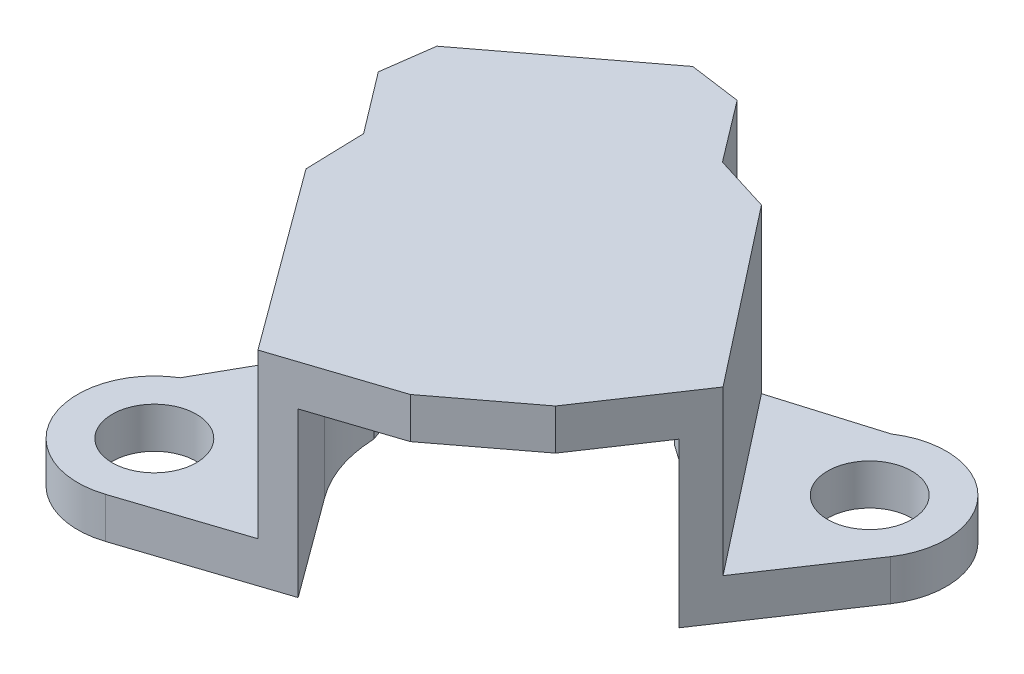
ISO-10303-21;
HEADER;
FILE_DESCRIPTION(('STEP AP214'),'2;1');
FILE_NAME('part.step','',(''),(''),'','','');
FILE_SCHEMA(('AUTOMOTIVE_DESIGN { 1 0 10303 214 1 1 1 1 }'));
ENDSEC;
DATA;
#1=APPLICATION_CONTEXT('core data for automotive mechanical design processes');
#2=APPLICATION_PROTOCOL_DEFINITION('international standard','automotive_design',2000,#1);
#3=PRODUCT_CONTEXT('',#1,'mechanical');
#4=PRODUCT('Part','Part','',(#3));
#5=PRODUCT_RELATED_PRODUCT_CATEGORY('part','',(#4));
#6=PRODUCT_DEFINITION_FORMATION('','',#4);
#7=PRODUCT_DEFINITION_CONTEXT('part definition',#1,'design');
#8=PRODUCT_DEFINITION('design','',#6,#7);
#9=PRODUCT_DEFINITION_SHAPE('','',#8);
#10=(LENGTH_UNIT() NAMED_UNIT(*) SI_UNIT(.MILLI.,.METRE.));
#11=(NAMED_UNIT(*) PLANE_ANGLE_UNIT() SI_UNIT($,.RADIAN.));
#12=(NAMED_UNIT(*) SI_UNIT($,.STERADIAN.) SOLID_ANGLE_UNIT());
#13=UNCERTAINTY_MEASURE_WITH_UNIT(LENGTH_MEASURE(1.E-05),#10,'distance_accuracy_value','');
#14=(GEOMETRIC_REPRESENTATION_CONTEXT(3) GLOBAL_UNCERTAINTY_ASSIGNED_CONTEXT((#13)) GLOBAL_UNIT_ASSIGNED_CONTEXT((#10,
#11,#12)) REPRESENTATION_CONTEXT('',''));
#15=CARTESIAN_POINT('',(0.,0.,0.));
#16=DIRECTION('',(0.,0.,1.));
#17=DIRECTION('',(1.,0.,0.));
#18=AXIS2_PLACEMENT_3D('',#15,#16,#17);
#19=CARTESIAN_POINT('',(0.,0.,0.));
#20=DIRECTION('',(0.,1.,0.));
#21=DIRECTION('',(0.,0.,1.));
#22=AXIS2_PLACEMENT_3D('',#19,#20,#21);
#23=PLANE('',#22);
#24=CARTESIAN_POINT('',(-10.5064328223958,0.,9.86179941757788));
#25=DIRECTION('',(0.,1.,0.));
#26=DIRECTION('',(0.,0.,1.));
#27=AXIS2_PLACEMENT_3D('',#24,#25,#26);
#28=CIRCLE('',#27,2.61619999992092);
#29=CARTESIAN_POINT('',(-10.5064328223958,0.,12.4779994174988));
#30=VERTEX_POINT('',#29);
#31=EDGE_CURVE('E192',#30,#30,#28,.T.);
#32=ORIENTED_EDGE('',*,*,#31,.T.);
#33=EDGE_LOOP('',(#32));
#34=FACE_BOUND('',#33,.T.);
#35=CARTESIAN_POINT('',(14.7920616338196,0.,-9.32279539828221));
#36=DIRECTION('',(0.,1.,0.));
#37=DIRECTION('',(0.,0.,1.));
#38=AXIS2_PLACEMENT_3D('',#35,#36,#37);
#39=CIRCLE('',#38,2.61619999992374);
#40=CARTESIAN_POINT('',(14.7920616338196,0.,-6.70659539835847));
#41=VERTEX_POINT('',#40);
#42=EDGE_CURVE('E233',#41,#41,#39,.T.);
#43=ORIENTED_EDGE('',*,*,#42,.T.);
#44=EDGE_LOOP('',(#43));
#45=FACE_BOUND('',#44,.T.);
#46=DIRECTION('',(0.591892658554333,0.,0.806016799297312));
#47=VECTOR('',#46,1.);
#48=CARTESIAN_POINT('',(-5.45155253612325,0.,4.00330852491869));
#49=LINE('',#48,#47);
#50=CARTESIAN_POINT('',(-4.57227275259217,0.,5.20067812659536));
#51=VERTEX_POINT('',#50);
#52=CARTESIAN_POINT('',(-0.00583235667560387,0.,11.4190821208067));
#53=VERTEX_POINT('',#52);
#54=EDGE_CURVE('E190',#51,#53,#49,.T.);
#55=ORIENTED_EDGE('',*,*,#54,.T.);
#56=DIRECTION('',(0.949859382125711,0.,-0.312677396349277));
#57=VECTOR('',#56,1.);
#58=CARTESIAN_POINT('',(3.39089213545186,0.,10.3009387510614));
#59=LINE('',#58,#57);
#60=CARTESIAN_POINT('',(-9.01730672237663,0.,14.3855047249459));
#61=VERTEX_POINT('',#60);
#62=EDGE_CURVE('E174',#61,#53,#59,.T.);
#63=ORIENTED_EDGE('',*,*,#62,.F.);
#64=CARTESIAN_POINT('',(-10.5064328223958,0.,9.86179941757788));
#65=DIRECTION('',(0.,1.,0.));
#66=DIRECTION('',(0.,0.,1.));
#67=AXIS2_PLACEMENT_3D('',#64,#65,#66);
#68=CIRCLE('',#67,4.76249999992099);
#69=CARTESIAN_POINT('',(-12.9701796141644,0.,5.7860960432242));
#70=VERTEX_POINT('',#69);
#71=EDGE_CURVE('E163',#70,#61,#68,.T.);
#72=ORIENTED_EDGE('',*,*,#71,.F.);
#73=DIRECTION('',(0.491262576943974,0.,-0.871011527187997));
#74=VECTOR('',#73,1.);
#75=CARTESIAN_POINT('',(-7.36412678812746,0.,-4.15346960396405));
#76=LINE('',#75,#74);
#77=CARTESIAN_POINT('',(-10.1498290810193,0.,0.785597449579397));
#78=VERTEX_POINT('',#77);
#79=EDGE_CURVE('E175',#70,#78,#76,.T.);
#80=ORIENTED_EDGE('',*,*,#79,.T.);
#81=DIRECTION('',(-0.0288086920511689,0.,-0.999584943495199));
#82=VECTOR('',#81,1.);
#83=CARTESIAN_POINT('',(-10.1640279658121,0.,0.292933935802079));
#84=LINE('',#83,#82);
#85=CARTESIAN_POINT('',(-10.2561205686825,0.,-2.90243429101753));
#86=VERTEX_POINT('',#85);
#87=EDGE_CURVE('E350',#78,#86,#84,.T.);
#88=ORIENTED_EDGE('',*,*,#87,.T.);
#89=DIRECTION('',(-0.604239206798796,0.,-0.79680297499894));
#90=VECTOR('',#89,1.);
#91=CARTESIAN_POINT('',(-5.11415462747085,0.,3.87821435475123));
#92=LINE('',#91,#90);
#93=CARTESIAN_POINT('',(-13.1267215123253,0.,-6.68786123152895));
#94=VERTEX_POINT('',#93);
#95=EDGE_CURVE('E414',#86,#94,#92,.T.);
#96=ORIENTED_EDGE('',*,*,#95,.T.);
#97=DIRECTION('',(0.136163146305156,0.,-0.990686427477575));
#98=VECTOR('',#97,1.);
#99=CARTESIAN_POINT('',(-13.7855057266784,0.,-1.89472448707263));
#100=LINE('',#99,#98);
#101=CARTESIAN_POINT('',(-12.6865207382198,0.,-9.89064365911864));
#102=VERTEX_POINT('',#101);
#103=EDGE_CURVE('E410',#94,#102,#100,.T.);
#104=ORIENTED_EDGE('',*,*,#103,.T.);
#105=DIRECTION('',(0.796802974998941,0.,-0.604239206798796));
#106=VECTOR('',#105,1.);
#107=CARTESIAN_POINT('',(-9.39385771159657,0.,-12.3875671871278));
#108=LINE('',#107,#106);
#109=CARTESIAN_POINT('',(-3.63977912067687,0.,-16.7510547652708));
#110=VERTEX_POINT('',#109);
#111=EDGE_CURVE('E406',#102,#110,#108,.T.);
#112=ORIENTED_EDGE('',*,*,#111,.T.);
#113=DIRECTION('',(0.990686427477575,0.,0.136163146305156));
#114=VECTOR('',#113,1.);
#115=CARTESIAN_POINT('',(2.19215024415396,0.,-15.9494955338935));
#116=LINE('',#115,#114);
#117=CARTESIAN_POINT('',(-0.436996693087231,0.,-16.3108539911652));
#118=VERTEX_POINT('',#117);
#119=EDGE_CURVE('E402',#110,#118,#116,.T.);
#120=ORIENTED_EDGE('',*,*,#119,.T.);
#121=DIRECTION('',(0.604239206798796,0.,0.796802974998941));
#122=VECTOR('',#121,1.);
#123=CARTESIAN_POINT('',(7.57557019176729,0.,-5.74477840488503));
#124=LINE('',#123,#122);
#125=CARTESIAN_POINT('',(2.43360425055577,0.,-12.5254270506537));
#126=VERTEX_POINT('',#125);
#127=EDGE_CURVE('E398',#118,#126,#124,.T.);
#128=ORIENTED_EDGE('',*,*,#127,.T.);
#129=DIRECTION('',(0.954747233375275,0.,0.29741842640001));
#130=VECTOR('',#129,1.);
#131=CARTESIAN_POINT('',(3.77198408182087,0.,-12.1085011781029));
#132=LINE('',#131,#130);
#133=CARTESIAN_POINT('',(5.95620442966988,0.,-11.4280829940444));
#134=VERTEX_POINT('',#133);
#135=EDGE_CURVE('E394',#126,#134,#132,.T.);
#136=ORIENTED_EDGE('',*,*,#135,.T.);
#137=DIRECTION('',(0.957633513743613,0.,-0.287989675778597));
#138=VECTOR('',#137,1.);
#139=CARTESIAN_POINT('',(-2.65773861042091,0.,-8.83760696361255));
#140=LINE('',#139,#138);
#141=CARTESIAN_POINT('',(12.1651755509115,0.,-13.2953104400561));
#142=VERTEX_POINT('',#141);
#143=EDGE_CURVE('E306',#134,#142,#140,.T.);
#144=ORIENTED_EDGE('',*,*,#143,.T.);
#145=CARTESIAN_POINT('',(14.7920616338196,0.,-9.32279539828221));
#146=DIRECTION('',(0.,1.,0.));
#147=DIRECTION('',(0.,0.,1.));
#148=AXIS2_PLACEMENT_3D('',#145,#146,#147);
#149=CIRCLE('',#148,4.76249999992396);
#150=CARTESIAN_POINT('',(18.7462730337282,0.,-6.66843700979547));
#151=VERTEX_POINT('',#150);
#152=EDGE_CURVE('E326',#151,#142,#149,.T.);
#153=ORIENTED_EDGE('',*,*,#152,.F.);
#154=DIRECTION('',(0.557345593389218,0.,-0.830280608908591));
#155=VECTOR('',#154,1.);
#156=CARTESIAN_POINT('',(9.83720036227,0.,6.60345456026617));
#157=LINE('',#156,#155);
#158=CARTESIAN_POINT('',(13.4563241890389,0.,1.21202710439891));
#159=VERTEX_POINT('',#158);
#160=EDGE_CURVE('E344',#159,#151,#157,.T.);
#161=ORIENTED_EDGE('',*,*,#160,.F.);
#162=DIRECTION('',(0.616442349857737,0.,0.787400044006776));
#163=VECTOR('',#162,1.);
#164=CARTESIAN_POINT('',(7.75460336690731,0.,-6.07094952317519));
#165=LINE('',#164,#163);
#166=CARTESIAN_POINT('',(8.85790156401936,0.,-4.66167410730036));
#167=VERTEX_POINT('',#166);
#168=EDGE_CURVE('E657',#167,#159,#165,.T.);
#169=ORIENTED_EDGE('',*,*,#168,.F.);
#170=CARTESIAN_POINT('',(2.14281440571359,0.,0.269502009647501));
#171=DIRECTION('',(0.,1.,0.));
#172=DIRECTION('',(0.,0.,1.));
#173=AXIS2_PLACEMENT_3D('',#170,#171,#172);
#174=CIRCLE('',#173,8.3312);
#175=CARTESIAN_POINT('',(4.64685949666317,0.,-7.67648135444855));
#176=VERTEX_POINT('',#175);
#177=EDGE_CURVE('E248',#167,#176,#174,.T.);
#178=ORIENTED_EDGE('',*,*,#177,.T.);
#179=DIRECTION('',(0.817560859082434,0.,0.575842202080042));
#180=VECTOR('',#179,1.);
#181=CARTESIAN_POINT('',(5.154852150732,0.,-7.31868094691952));
#182=LINE('',#181,#180);
#183=CARTESIAN_POINT('',(3.51245343906386,0.,-8.47549084102558));
#184=VERTEX_POINT('',#183);
#185=EDGE_CURVE('E231',#184,#176,#182,.T.);
#186=ORIENTED_EDGE('',*,*,#185,.F.);
#187=DIRECTION('',(0.591892658554333,0.,0.806016799297312));
#188=VECTOR('',#187,1.);
#189=CARTESIAN_POINT('',(6.32535972724051,0.,-4.644982571744));
#190=LINE('',#189,#188);
#191=CARTESIAN_POINT('',(-1.89254794847399,0.,-15.8358151424308));
#192=VERTEX_POINT('',#191);
#193=EDGE_CURVE('E267',#192,#184,#190,.T.);
#194=ORIENTED_EDGE('',*,*,#193,.F.);
#195=DIRECTION('',(0.806016799297312,0.,-0.591892658554333));
#196=VECTOR('',#195,1.);
#197=CARTESIAN_POINT('',(-8.2179076757145,0.,-11.1908325706868));
#198=LINE('',#197,#196);
#199=CARTESIAN_POINT('',(-12.1686873808379,0.,-8.28960581577715));
#200=VERTEX_POINT('',#199);
#201=EDGE_CURVE('E272',#200,#192,#198,.T.);
#202=ORIENTED_EDGE('',*,*,#201,.F.);
#203=DIRECTION('',(0.591892658554333,0.,0.806016799297312));
#204=VECTOR('',#203,1.);
#205=CARTESIAN_POINT('',(-3.95077970512336,0.,2.90122675490961));
#206=LINE('',#205,#204);
#207=CARTESIAN_POINT('',(-6.64742193455265,0.,-0.77095756297552));
#208=VERTEX_POINT('',#207);
#209=EDGE_CURVE('E276',#200,#208,#206,.T.);
#210=ORIENTED_EDGE('',*,*,#209,.T.);
#211=DIRECTION('',(0.333919796724786,0.,0.942601490214861));
#212=VECTOR('',#211,1.);
#213=CARTESIAN_POINT('',(-5.66355679576052,0.,2.0063343349357));
#214=LINE('',#213,#212);
#215=CARTESIAN_POINT('',(-6.18409172989725,0.,0.536948543980139));
#216=VERTEX_POINT('',#215);
#217=EDGE_CURVE('E280',#208,#216,#214,.T.);
#218=ORIENTED_EDGE('',*,*,#217,.T.);
#219=EDGE_CURVE('E242',#216,#51,#174,.T.);
#220=ORIENTED_EDGE('',*,*,#219,.T.);
#221=EDGE_LOOP('',(#55,#63,#72,#80,#88,#96,#104,#112,#120,#128,#136,#144,#153,#161,#169,#178,
#186,#194,#202,#210,#218,#220));
#222=FACE_BOUND('',#221,.T.);
#223=ADVANCED_FACE('F125',(#34,#45,#222),#23,.F.);
#224=CARTESIAN_POINT('',(3.39089213545186,2.54,10.3009387510614));
#225=DIRECTION('',(-0.312677396349277,0.,-0.949859382125711));
#226=DIRECTION('',(-0.949859382125711,0.,0.312677396349277));
#227=AXIS2_PLACEMENT_3D('',#224,#225,#226);
#228=PLANE('',#227);
#229=DIRECTION('',(0.,-1.,0.));
#230=VECTOR('',#229,1.);
#231=CARTESIAN_POINT('',(-0.00583235667560387,10.16,11.4190821208067));
#232=LINE('',#231,#230);
#233=CARTESIAN_POINT('',(-0.00583235667560387,10.16,11.4190821208067));
#234=VERTEX_POINT('',#233);
#235=EDGE_CURVE('E652',#234,#53,#232,.T.);
#236=ORIENTED_EDGE('',*,*,#235,.F.);
#237=DIRECTION('',(0.949859382125711,0.,-0.312677396349277));
#238=VECTOR('',#237,1.);
#239=CARTESIAN_POINT('',(3.39089213545186,10.16,10.3009387510614));
#240=LINE('',#239,#238);
#241=CARTESIAN_POINT('',(5.24416769680156,10.16,9.69087226317373));
#242=VERTEX_POINT('',#241);
#243=EDGE_CURVE('E655',#234,#242,#240,.T.);
#244=ORIENTED_EDGE('',*,*,#243,.T.);
#245=DIRECTION('',(0.,-1.,0.));
#246=VECTOR('',#245,1.);
#247=CARTESIAN_POINT('',(5.24416769680156,36.8582496996697,9.69087226317373));
#248=LINE('',#247,#246);
#249=CARTESIAN_POINT('',(5.24416769680156,12.7,9.69087226317373));
#250=VERTEX_POINT('',#249);
#251=EDGE_CURVE('E268',#250,#242,#248,.T.);
#252=ORIENTED_EDGE('',*,*,#251,.F.);
#253=DIRECTION('',(0.949859382125711,0.,-0.312677396349277));
#254=VECTOR('',#253,1.);
#255=CARTESIAN_POINT('',(3.39089213545186,12.7,10.3009387510614));
#256=LINE('',#255,#254);
#257=CARTESIAN_POINT('',(-1.88656951278063,12.7,12.0381884940808));
#258=VERTEX_POINT('',#257);
#259=EDGE_CURVE('E386',#258,#250,#256,.T.);
#260=ORIENTED_EDGE('',*,*,#259,.F.);
#261=DIRECTION('',(0.,-1.,0.));
#262=VECTOR('',#261,1.);
#263=CARTESIAN_POINT('',(-1.88656951278063,12.7,12.0381884940808));
#264=LINE('',#263,#262);
#265=CARTESIAN_POINT('',(-1.88656951278063,2.54,12.0381884940808));
#266=VERTEX_POINT('',#265);
#267=EDGE_CURVE('E390',#258,#266,#264,.T.);
#268=ORIENTED_EDGE('',*,*,#267,.T.);
#269=DIRECTION('',(0.949859382125711,0.,-0.312677396349277));
#270=VECTOR('',#269,1.);
#271=CARTESIAN_POINT('',(3.39089213545186,2.54,10.3009387510614));
#272=LINE('',#271,#270);
#273=CARTESIAN_POINT('',(-9.01730672237663,2.54,14.3855047249459));
#274=VERTEX_POINT('',#273);
#275=EDGE_CURVE('E183',#274,#266,#272,.T.);
#276=ORIENTED_EDGE('',*,*,#275,.F.);
#277=DIRECTION('',(0.,-1.,0.));
#278=VECTOR('',#277,1.);
#279=CARTESIAN_POINT('',(-9.01730672237663,2.54,14.3855047249459));
#280=LINE('',#279,#278);
#281=EDGE_CURVE('E166',#274,#61,#280,.T.);
#282=ORIENTED_EDGE('',*,*,#281,.T.);
#283=ORIENTED_EDGE('',*,*,#62,.T.);
#284=EDGE_LOOP('',(#236,#244,#252,#260,#268,#276,#282,#283));
#285=FACE_BOUND('',#284,.T.);
#286=ADVANCED_FACE('F180',(#285),#228,.F.);
#287=CARTESIAN_POINT('',(2.14281440571359,10.16,0.269502009647501));
#288=DIRECTION('',(0.,-1.,0.));
#289=DIRECTION('',(0.,0.,-1.));
#290=AXIS2_PLACEMENT_3D('',#287,#288,#289);
#291=CYLINDRICAL_SURFACE('',#290,8.3312);
#292=CARTESIAN_POINT('',(2.14281440571359,10.16,0.269502009647501));
#293=DIRECTION('',(0.,1.,0.));
#294=DIRECTION('',(0.,0.,1.));
#295=AXIS2_PLACEMENT_3D('',#292,#293,#294);
#296=CIRCLE('',#295,8.3312);
#297=CARTESIAN_POINT('',(-6.18409172989725,10.16,0.536948543980139));
#298=VERTEX_POINT('',#297);
#299=CARTESIAN_POINT('',(-4.57227275259217,10.16,5.20067812659536));
#300=VERTEX_POINT('',#299);
#301=EDGE_CURVE('E12',#298,#300,#296,.T.);
#302=ORIENTED_EDGE('',*,*,#301,.T.);
#303=DIRECTION('',(0.,-1.,0.));
#304=VECTOR('',#303,1.);
#305=CARTESIAN_POINT('',(-4.57227275259217,10.16,5.20067812659536));
#306=LINE('',#305,#304);
#307=EDGE_CURVE('E644',#300,#51,#306,.T.);
#308=ORIENTED_EDGE('',*,*,#307,.T.);
#309=ORIENTED_EDGE('',*,*,#219,.F.);
#310=DIRECTION('',(0.,-1.,0.));
#311=VECTOR('',#310,1.);
#312=CARTESIAN_POINT('',(-6.18409172989725,10.16,0.536948543980139));
#313=LINE('',#312,#311);
#314=EDGE_CURVE('E263',#298,#216,#313,.T.);
#315=ORIENTED_EDGE('',*,*,#314,.F.);
#316=EDGE_LOOP('',(#302,#308,#309,#315));
#317=FACE_BOUND('',#316,.T.);
#318=ADVANCED_FACE('F660',(#317),#291,.F.);
#319=CARTESIAN_POINT('',(-7.36412678812746,2.54,-4.15346960396405));
#320=DIRECTION('',(-0.871011527187996,0.,-0.491262576943974));
#321=DIRECTION('',(-0.491262576943974,0.,0.871011527187997));
#322=AXIS2_PLACEMENT_3D('',#319,#320,#321);
#323=PLANE('',#322);
#324=ORIENTED_EDGE('',*,*,#79,.F.);
#325=DIRECTION('',(0.,-1.,0.));
#326=VECTOR('',#325,1.);
#327=CARTESIAN_POINT('',(-12.9701796141644,2.54,5.7860960432242));
#328=LINE('',#327,#326);
#329=CARTESIAN_POINT('',(-12.9701796141644,2.54,5.7860960432242));
#330=VERTEX_POINT('',#329);
#331=EDGE_CURVE('E168',#330,#70,#328,.T.);
#332=ORIENTED_EDGE('',*,*,#331,.F.);
#333=DIRECTION('',(0.491262576943974,0.,-0.871011527187997));
#334=VECTOR('',#333,1.);
#335=CARTESIAN_POINT('',(-7.36412678812746,2.54,-4.15346960396405));
#336=LINE('',#335,#334);
#337=CARTESIAN_POINT('',(-10.1498290810193,2.54,0.785597449579397));
#338=VERTEX_POINT('',#337);
#339=EDGE_CURVE('E196',#330,#338,#336,.T.);
#340=ORIENTED_EDGE('',*,*,#339,.T.);
#341=DIRECTION('',(0.,-1.,0.));
#342=VECTOR('',#341,1.);
#343=CARTESIAN_POINT('',(-10.1498290810193,2.54,0.785597449579397));
#344=LINE('',#343,#342);
#345=EDGE_CURVE('E185',#338,#78,#344,.T.);
#346=ORIENTED_EDGE('',*,*,#345,.T.);
#347=EDGE_LOOP('',(#324,#332,#340,#346));
#348=FACE_BOUND('',#347,.T.);
#349=ADVANCED_FACE('F127',(#348),#323,.T.);
#350=CARTESIAN_POINT('',(-10.5064328223958,2.54,9.86179941757788));
#351=DIRECTION('',(0.,-1.,0.));
#352=DIRECTION('',(0.,0.,-1.));
#353=AXIS2_PLACEMENT_3D('',#350,#351,#352);
#354=CYLINDRICAL_SURFACE('',#353,4.76249999992099);
#355=ORIENTED_EDGE('',*,*,#71,.T.);
#356=ORIENTED_EDGE('',*,*,#281,.F.);
#357=CARTESIAN_POINT('',(-10.5064328223958,2.54,9.86179941757788));
#358=DIRECTION('',(0.,1.,0.));
#359=DIRECTION('',(0.,0.,1.));
#360=AXIS2_PLACEMENT_3D('',#357,#358,#359);
#361=CIRCLE('',#360,4.76249999992099);
#362=EDGE_CURVE('E150',#330,#274,#361,.T.);
#363=ORIENTED_EDGE('',*,*,#362,.F.);
#364=ORIENTED_EDGE('',*,*,#331,.T.);
#365=EDGE_LOOP('',(#355,#356,#363,#364));
#366=FACE_BOUND('',#365,.T.);
#367=ADVANCED_FACE('F165',(#366),#354,.T.);
#368=CARTESIAN_POINT('',(-10.5064328223958,2.54,9.86179941757788));
#369=DIRECTION('',(0.,-1.,0.));
#370=DIRECTION('',(0.,0.,-1.));
#371=AXIS2_PLACEMENT_3D('',#368,#369,#370);
#372=CYLINDRICAL_SURFACE('',#371,2.61619999992092);
#373=CARTESIAN_POINT('',(-10.5064328223958,2.54,9.86179941757788));
#374=DIRECTION('',(0.,1.,0.));
#375=DIRECTION('',(0.,0.,1.));
#376=AXIS2_PLACEMENT_3D('',#373,#374,#375);
#377=CIRCLE('',#376,2.61619999992092);
#378=CARTESIAN_POINT('',(-10.5064328223958,2.54,12.4779994174988));
#379=VERTEX_POINT('',#378);
#380=EDGE_CURVE('E202',#379,#379,#377,.T.);
#381=ORIENTED_EDGE('',*,*,#380,.T.);
#382=EDGE_LOOP('',(#381));
#383=FACE_BOUND('',#382,.T.);
#384=ORIENTED_EDGE('',*,*,#31,.F.);
#385=EDGE_LOOP('',(#384));
#386=FACE_BOUND('',#385,.T.);
#387=ADVANCED_FACE('F732',(#383,#386),#372,.F.);
#388=CARTESIAN_POINT('',(0.,2.54,0.));
#389=DIRECTION('',(0.,1.,0.));
#390=DIRECTION('',(0.,0.,1.));
#391=AXIS2_PLACEMENT_3D('',#388,#389,#390);
#392=PLANE('',#391);
#393=ORIENTED_EDGE('',*,*,#339,.F.);
#394=ORIENTED_EDGE('',*,*,#362,.T.);
#395=ORIENTED_EDGE('',*,*,#275,.T.);
#396=DIRECTION('',(0.591892658554333,0.,0.806016799297312));
#397=VECTOR('',#396,1.);
#398=CARTESIAN_POINT('',(-6.96875846791621,2.54,5.11745782469289));
#399=LINE('',#398,#397);
#400=EDGE_CURVE('E466',#338,#266,#399,.T.);
#401=ORIENTED_EDGE('',*,*,#400,.F.);
#402=EDGE_LOOP('',(#393,#394,#395,#401));
#403=FACE_BOUND('',#402,.T.);
#404=ORIENTED_EDGE('',*,*,#380,.F.);
#405=EDGE_LOOP('',(#404));
#406=FACE_BOUND('',#405,.T.);
#407=ADVANCED_FACE('F730',(#403,#406),#392,.T.);
#408=CARTESIAN_POINT('',(9.83720036227,12.7,6.60345456026617));
#409=DIRECTION('',(-0.830280608908591,0.,-0.557345593389218));
#410=DIRECTION('',(-0.557345593389218,0.,0.830280608908591));
#411=AXIS2_PLACEMENT_3D('',#408,#409,#410);
#412=PLANE('',#411);
#413=DIRECTION('',(0.557345593389218,0.,-0.830280608908591));
#414=VECTOR('',#413,1.);
#415=CARTESIAN_POINT('',(9.83720036227,10.16,6.60345456026617));
#416=LINE('',#415,#414);
#417=CARTESIAN_POINT('',(10.3781186813111,10.16,5.79764574679343));
#418=VERTEX_POINT('',#417);
#419=CARTESIAN_POINT('',(13.4563241890389,10.16,1.21202710439891));
#420=VERTEX_POINT('',#419);
#421=EDGE_CURVE('E141',#418,#420,#416,.T.);
#422=ORIENTED_EDGE('',*,*,#421,.T.);
#423=DIRECTION('',(0.,-1.,0.));
#424=VECTOR('',#423,1.);
#425=CARTESIAN_POINT('',(13.4563241890389,10.16,1.21202710439891));
#426=LINE('',#425,#424);
#427=EDGE_CURVE('E686',#420,#159,#426,.T.);
#428=ORIENTED_EDGE('',*,*,#427,.T.);
#429=ORIENTED_EDGE('',*,*,#160,.T.);
#430=DIRECTION('',(0.,-1.,0.));
#431=VECTOR('',#430,1.);
#432=CARTESIAN_POINT('',(18.7462730337282,2.54,-6.66843700979547));
#433=LINE('',#432,#431);
#434=CARTESIAN_POINT('',(18.7462730337282,2.54,-6.66843700979547));
#435=VERTEX_POINT('',#434);
#436=EDGE_CURVE('E322',#435,#151,#433,.T.);
#437=ORIENTED_EDGE('',*,*,#436,.F.);
#438=DIRECTION('',(0.557345593389218,0.,-0.830280608908591));
#439=VECTOR('',#438,1.);
#440=CARTESIAN_POINT('',(9.83720036227,2.54,6.60345456026617));
#441=LINE('',#440,#439);
#442=CARTESIAN_POINT('',(14.562195857538,2.54,-0.435395631488704));
#443=VERTEX_POINT('',#442);
#444=EDGE_CURVE('E318',#443,#435,#441,.T.);
#445=ORIENTED_EDGE('',*,*,#444,.F.);
#446=DIRECTION('',(0.,-1.,0.));
#447=VECTOR('',#446,1.);
#448=CARTESIAN_POINT('',(14.562195857538,12.7,-0.435395631488704));
#449=LINE('',#448,#447);
#450=CARTESIAN_POINT('',(14.562195857538,12.7,-0.435395631488704));
#451=VERTEX_POINT('',#450);
#452=EDGE_CURVE('E455',#451,#443,#449,.T.);
#453=ORIENTED_EDGE('',*,*,#452,.F.);
#454=DIRECTION('',(0.557345593389218,0.,-0.830280608908591));
#455=VECTOR('',#454,1.);
#456=CARTESIAN_POINT('',(9.83720036227,12.7,6.60345456026617));
#457=LINE('',#456,#455);
#458=CARTESIAN_POINT('',(10.3781186813111,12.7,5.79764574679343));
#459=VERTEX_POINT('',#458);
#460=EDGE_CURVE('E345',#459,#451,#457,.T.);
#461=ORIENTED_EDGE('',*,*,#460,.F.);
#462=DIRECTION('',(0.,-1.,0.));
#463=VECTOR('',#462,1.);
#464=CARTESIAN_POINT('',(10.3781186813111,36.8582496996697,5.79764574679343));
#465=LINE('',#464,#463);
#466=EDGE_CURVE('E251',#459,#418,#465,.T.);
#467=ORIENTED_EDGE('',*,*,#466,.T.);
#468=EDGE_LOOP('',(#422,#428,#429,#437,#445,#453,#461,#467));
#469=FACE_BOUND('',#468,.T.);
#470=ADVANCED_FACE('F578',(#469),#412,.F.);
#471=CARTESIAN_POINT('',(9.23987964704549,12.7,-7.23374752818579));
#472=DIRECTION('',(0.787400044006776,0.,-0.616442349857736));
#473=DIRECTION('',(-0.616442349857736,0.,-0.787400044006776));
#474=AXIS2_PLACEMENT_3D('',#471,#472,#473);
#475=PLANE('',#474);
#476=DIRECTION('',(0.616442349857736,0.,0.787400044006776));
#477=VECTOR('',#476,1.);
#478=CARTESIAN_POINT('',(9.23987964704549,2.54,-7.23374752818579));
#479=LINE('',#478,#477);
#480=CARTESIAN_POINT('',(5.95620442966988,2.54,-11.4280829940444));
#481=VERTEX_POINT('',#480);
#482=EDGE_CURVE('E314',#481,#443,#479,.T.);
#483=ORIENTED_EDGE('',*,*,#482,.F.);
#484=DIRECTION('',(0.,-1.,0.));
#485=VECTOR('',#484,1.);
#486=CARTESIAN_POINT('',(5.95620442966988,12.7,-11.4280829940444));
#487=LINE('',#486,#485);
#488=CARTESIAN_POINT('',(5.95620442966988,12.7,-11.4280829940444));
#489=VERTEX_POINT('',#488);
#490=EDGE_CURVE('E451',#489,#481,#487,.T.);
#491=ORIENTED_EDGE('',*,*,#490,.F.);
#492=DIRECTION('',(0.616442349857736,0.,0.787400044006776));
#493=VECTOR('',#492,1.);
#494=CARTESIAN_POINT('',(9.23987964704549,12.7,-7.23374752818579));
#495=LINE('',#494,#493);
#496=EDGE_CURVE('E349',#489,#451,#495,.T.);
#497=ORIENTED_EDGE('',*,*,#496,.T.);
#498=ORIENTED_EDGE('',*,*,#452,.T.);
#499=EDGE_LOOP('',(#483,#491,#497,#498));
#500=FACE_BOUND('',#499,.T.);
#501=ADVANCED_FACE('F571',(#500),#475,.T.);
#502=CARTESIAN_POINT('',(3.77198408182087,12.7,-12.1085011781029));
#503=DIRECTION('',(0.29741842640001,0.,-0.954747233375275));
#504=DIRECTION('',(-0.954747233375275,0.,-0.29741842640001));
#505=AXIS2_PLACEMENT_3D('',#502,#503,#504);
#506=PLANE('',#505);
#507=ORIENTED_EDGE('',*,*,#135,.F.);
#508=DIRECTION('',(0.,-1.,0.));
#509=VECTOR('',#508,1.);
#510=CARTESIAN_POINT('',(2.43360425055577,12.7,-12.5254270506537));
#511=LINE('',#510,#509);
#512=CARTESIAN_POINT('',(2.43360425055577,12.7,-12.5254270506537));
#513=VERTEX_POINT('',#512);
#514=EDGE_CURVE('E447',#513,#126,#511,.T.);
#515=ORIENTED_EDGE('',*,*,#514,.F.);
#516=DIRECTION('',(0.954747233375275,0.,0.29741842640001));
#517=VECTOR('',#516,1.);
#518=CARTESIAN_POINT('',(3.77198408182087,12.7,-12.1085011781029));
#519=LINE('',#518,#517);
#520=EDGE_CURVE('E354',#513,#489,#519,.T.);
#521=ORIENTED_EDGE('',*,*,#520,.T.);
#522=ORIENTED_EDGE('',*,*,#490,.T.);
#523=DIRECTION('',(0.,-1.,0.));
#524=VECTOR('',#523,1.);
#525=CARTESIAN_POINT('',(5.95620442966988,2.54,-11.4280829940444));
#526=LINE('',#525,#524);
#527=EDGE_CURVE('E336',#481,#134,#526,.T.);
#528=ORIENTED_EDGE('',*,*,#527,.T.);
#529=EDGE_LOOP('',(#507,#515,#521,#522,#528));
#530=FACE_BOUND('',#529,.T.);
#531=ADVANCED_FACE('F552',(#530),#506,.T.);
#532=CARTESIAN_POINT('',(7.57557019176729,12.7,-5.74477840488503));
#533=DIRECTION('',(0.796802974998941,0.,-0.604239206798796));
#534=DIRECTION('',(-0.604239206798796,0.,-0.796802974998941));
#535=AXIS2_PLACEMENT_3D('',#532,#533,#534);
#536=PLANE('',#535);
#537=ORIENTED_EDGE('',*,*,#127,.F.);
#538=DIRECTION('',(0.,-1.,0.));
#539=VECTOR('',#538,1.);
#540=CARTESIAN_POINT('',(-0.436996693087231,12.7,-16.3108539911652));
#541=LINE('',#540,#539);
#542=CARTESIAN_POINT('',(-0.436996693087231,12.7,-16.3108539911652));
#543=VERTEX_POINT('',#542);
#544=EDGE_CURVE('E443',#543,#118,#541,.T.);
#545=ORIENTED_EDGE('',*,*,#544,.F.);
#546=DIRECTION('',(0.604239206798796,0.,0.796802974998941));
#547=VECTOR('',#546,1.);
#548=CARTESIAN_POINT('',(7.57557019176729,12.7,-5.74477840488503));
#549=LINE('',#548,#547);
#550=EDGE_CURVE('E358',#543,#513,#549,.T.);
#551=ORIENTED_EDGE('',*,*,#550,.T.);
#552=ORIENTED_EDGE('',*,*,#514,.T.);
#553=EDGE_LOOP('',(#537,#545,#551,#552));
#554=FACE_BOUND('',#553,.T.);
#555=ADVANCED_FACE('F546',(#554),#536,.T.);
#556=CARTESIAN_POINT('',(2.19215024415396,12.7,-15.9494955338935));
#557=DIRECTION('',(0.136163146305156,0.,-0.990686427477575));
#558=DIRECTION('',(-0.990686427477575,0.,-0.136163146305156));
#559=AXIS2_PLACEMENT_3D('',#556,#557,#558);
#560=PLANE('',#559);
#561=ORIENTED_EDGE('',*,*,#119,.F.);
#562=DIRECTION('',(0.,-1.,0.));
#563=VECTOR('',#562,1.);
#564=CARTESIAN_POINT('',(-3.63977912067687,12.7,-16.7510547652708));
#565=LINE('',#564,#563);
#566=CARTESIAN_POINT('',(-3.63977912067687,12.7,-16.7510547652708));
#567=VERTEX_POINT('',#566);
#568=EDGE_CURVE('E439',#567,#110,#565,.T.);
#569=ORIENTED_EDGE('',*,*,#568,.F.);
#570=DIRECTION('',(0.990686427477575,0.,0.136163146305156));
#571=VECTOR('',#570,1.);
#572=CARTESIAN_POINT('',(2.19215024415396,12.7,-15.9494955338935));
#573=LINE('',#572,#571);
#574=EDGE_CURVE('E362',#567,#543,#573,.T.);
#575=ORIENTED_EDGE('',*,*,#574,.T.);
#576=ORIENTED_EDGE('',*,*,#544,.T.);
#577=EDGE_LOOP('',(#561,#569,#575,#576));
#578=FACE_BOUND('',#577,.T.);
#579=ADVANCED_FACE('F540',(#578),#560,.T.);
#580=CARTESIAN_POINT('',(-9.39385771159657,12.7,-12.3875671871278));
#581=DIRECTION('',(-0.604239206798796,0.,-0.796802974998941));
#582=DIRECTION('',(-0.796802974998941,0.,0.604239206798796));
#583=AXIS2_PLACEMENT_3D('',#580,#581,#582);
#584=PLANE('',#583);
#585=ORIENTED_EDGE('',*,*,#111,.F.);
#586=DIRECTION('',(0.,-1.,0.));
#587=VECTOR('',#586,1.);
#588=CARTESIAN_POINT('',(-12.6865207382198,12.7,-9.89064365911864));
#589=LINE('',#588,#587);
#590=CARTESIAN_POINT('',(-12.6865207382198,12.7,-9.89064365911864));
#591=VERTEX_POINT('',#590);
#592=EDGE_CURVE('E435',#591,#102,#589,.T.);
#593=ORIENTED_EDGE('',*,*,#592,.F.);
#594=DIRECTION('',(0.796802974998941,0.,-0.604239206798796));
#595=VECTOR('',#594,1.);
#596=CARTESIAN_POINT('',(-9.39385771159657,12.7,-12.3875671871278));
#597=LINE('',#596,#595);
#598=EDGE_CURVE('E366',#591,#567,#597,.T.);
#599=ORIENTED_EDGE('',*,*,#598,.T.);
#600=ORIENTED_EDGE('',*,*,#568,.T.);
#601=EDGE_LOOP('',(#585,#593,#599,#600));
#602=FACE_BOUND('',#601,.T.);
#603=ADVANCED_FACE('F534',(#602),#584,.T.);
#604=CARTESIAN_POINT('',(-13.7855057266784,12.7,-1.89472448707263));
#605=DIRECTION('',(-0.990686427477575,0.,-0.136163146305156));
#606=DIRECTION('',(-0.136163146305156,0.,0.990686427477575));
#607=AXIS2_PLACEMENT_3D('',#604,#605,#606);
#608=PLANE('',#607);
#609=ORIENTED_EDGE('',*,*,#103,.F.);
#610=DIRECTION('',(0.,-1.,0.));
#611=VECTOR('',#610,1.);
#612=CARTESIAN_POINT('',(-13.1267215123253,12.7,-6.68786123152895));
#613=LINE('',#612,#611);
#614=CARTESIAN_POINT('',(-13.1267215123253,12.7,-6.68786123152895));
#615=VERTEX_POINT('',#614);
#616=EDGE_CURVE('E431',#615,#94,#613,.T.);
#617=ORIENTED_EDGE('',*,*,#616,.F.);
#618=DIRECTION('',(0.136163146305156,0.,-0.990686427477575));
#619=VECTOR('',#618,1.);
#620=CARTESIAN_POINT('',(-13.7855057266784,12.7,-1.89472448707263));
#621=LINE('',#620,#619);
#622=EDGE_CURVE('E370',#615,#591,#621,.T.);
#623=ORIENTED_EDGE('',*,*,#622,.T.);
#624=ORIENTED_EDGE('',*,*,#592,.T.);
#625=EDGE_LOOP('',(#609,#617,#623,#624));
#626=FACE_BOUND('',#625,.T.);
#627=ADVANCED_FACE('F529',(#626),#608,.T.);
#628=CARTESIAN_POINT('',(-5.11415462747085,12.7,3.87821435475123));
#629=DIRECTION('',(-0.79680297499894,0.,0.604239206798796));
#630=DIRECTION('',(0.604239206798796,0.,0.79680297499894));
#631=AXIS2_PLACEMENT_3D('',#628,#629,#630);
#632=PLANE('',#631);
#633=ORIENTED_EDGE('',*,*,#95,.F.);
#634=DIRECTION('',(0.,-1.,0.));
#635=VECTOR('',#634,1.);
#636=CARTESIAN_POINT('',(-10.2561205686825,12.7,-2.90243429101753));
#637=LINE('',#636,#635);
#638=CARTESIAN_POINT('',(-10.2561205686825,12.7,-2.90243429101753));
#639=VERTEX_POINT('',#638);
#640=EDGE_CURVE('E427',#639,#86,#637,.T.);
#641=ORIENTED_EDGE('',*,*,#640,.F.);
#642=DIRECTION('',(-0.604239206798796,0.,-0.79680297499894));
#643=VECTOR('',#642,1.);
#644=CARTESIAN_POINT('',(-5.11415462747085,12.7,3.87821435475123));
#645=LINE('',#644,#643);
#646=EDGE_CURVE('E374',#639,#615,#645,.T.);
#647=ORIENTED_EDGE('',*,*,#646,.T.);
#648=ORIENTED_EDGE('',*,*,#616,.T.);
#649=EDGE_LOOP('',(#633,#641,#647,#648));
#650=FACE_BOUND('',#649,.T.);
#651=ADVANCED_FACE('F527',(#650),#632,.T.);
#652=CARTESIAN_POINT('',(-10.1640279658121,12.7,0.292933935802079));
#653=DIRECTION('',(-0.999584943495199,0.,0.0288086920511689));
#654=DIRECTION('',(0.0288086920511689,0.,0.999584943495199));
#655=AXIS2_PLACEMENT_3D('',#652,#653,#654);
#656=PLANE('',#655);
#657=ORIENTED_EDGE('',*,*,#87,.F.);
#658=ORIENTED_EDGE('',*,*,#345,.F.);
#659=DIRECTION('',(0.,-1.,0.));
#660=VECTOR('',#659,1.);
#661=CARTESIAN_POINT('',(-10.1498290810193,12.7,0.785597449579397));
#662=LINE('',#661,#660);
#663=CARTESIAN_POINT('',(-10.1498290810193,12.7,0.785597449579397));
#664=VERTEX_POINT('',#663);
#665=EDGE_CURVE('E423',#664,#338,#662,.T.);
#666=ORIENTED_EDGE('',*,*,#665,.F.);
#667=DIRECTION('',(-0.0288086920511689,0.,-0.999584943495199));
#668=VECTOR('',#667,1.);
#669=CARTESIAN_POINT('',(-10.1640279658121,12.7,0.292933935802079));
#670=LINE('',#669,#668);
#671=EDGE_CURVE('E378',#664,#639,#670,.T.);
#672=ORIENTED_EDGE('',*,*,#671,.T.);
#673=ORIENTED_EDGE('',*,*,#640,.T.);
#674=EDGE_LOOP('',(#657,#658,#666,#672,#673));
#675=FACE_BOUND('',#674,.T.);
#676=ADVANCED_FACE('F483',(#675),#656,.T.);
#677=CARTESIAN_POINT('',(-6.96875846791621,12.7,5.11745782469289));
#678=DIRECTION('',(0.806016799297312,0.,-0.591892658554333));
#679=DIRECTION('',(-0.591892658554333,0.,-0.806016799297312));
#680=AXIS2_PLACEMENT_3D('',#677,#678,#679);
#681=PLANE('',#680);
#682=ORIENTED_EDGE('',*,*,#400,.T.);
#683=ORIENTED_EDGE('',*,*,#267,.F.);
#684=DIRECTION('',(0.591892658554333,0.,0.806016799297312));
#685=VECTOR('',#684,1.);
#686=CARTESIAN_POINT('',(-6.96875846791621,12.7,5.11745782469289));
#687=LINE('',#686,#685);
#688=EDGE_CURVE('E382',#664,#258,#687,.T.);
#689=ORIENTED_EDGE('',*,*,#688,.F.);
#690=ORIENTED_EDGE('',*,*,#665,.T.);
#691=EDGE_LOOP('',(#682,#683,#689,#690));
#692=FACE_BOUND('',#691,.T.);
#693=ADVANCED_FACE('F488',(#692),#681,.F.);
#694=CARTESIAN_POINT('',(0.,12.7,0.));
#695=DIRECTION('',(0.,1.,0.));
#696=DIRECTION('',(0.,0.,1.));
#697=AXIS2_PLACEMENT_3D('',#694,#695,#696);
#698=PLANE('',#697);
#699=DIRECTION('',(0.796802975001504,0.,-0.604239206795415));
#700=VECTOR('',#699,1.);
#701=CARTESIAN_POINT('',(6.58043540682666,12.7,8.67754103010402));
#702=LINE('',#701,#700);
#703=EDGE_CURVE('E651',#250,#459,#702,.T.);
#704=ORIENTED_EDGE('',*,*,#703,.T.);
#705=ORIENTED_EDGE('',*,*,#460,.T.);
#706=ORIENTED_EDGE('',*,*,#496,.F.);
#707=ORIENTED_EDGE('',*,*,#520,.F.);
#708=ORIENTED_EDGE('',*,*,#550,.F.);
#709=ORIENTED_EDGE('',*,*,#574,.F.);
#710=ORIENTED_EDGE('',*,*,#598,.F.);
#711=ORIENTED_EDGE('',*,*,#622,.F.);
#712=ORIENTED_EDGE('',*,*,#646,.F.);
#713=ORIENTED_EDGE('',*,*,#671,.F.);
#714=ORIENTED_EDGE('',*,*,#688,.T.);
#715=ORIENTED_EDGE('',*,*,#259,.T.);
#716=EDGE_LOOP('',(#704,#705,#706,#707,#708,#709,#710,#711,#712,#713,#714,#715));
#717=FACE_BOUND('',#716,.T.);
#718=ADVANCED_FACE('F498',(#717),#698,.T.);
#719=CARTESIAN_POINT('',(14.7920616338196,2.54,-9.32279539828221));
#720=DIRECTION('',(0.,-1.,0.));
#721=DIRECTION('',(0.,0.,-1.));
#722=AXIS2_PLACEMENT_3D('',#719,#720,#721);
#723=CYLINDRICAL_SURFACE('',#722,4.76249999992396);
#724=ORIENTED_EDGE('',*,*,#152,.T.);
#725=DIRECTION('',(0.,-1.,0.));
#726=VECTOR('',#725,1.);
#727=CARTESIAN_POINT('',(12.1651755509115,2.54,-13.2953104400561));
#728=LINE('',#727,#726);
#729=CARTESIAN_POINT('',(12.1651755509115,2.54,-13.2953104400561));
#730=VERTEX_POINT('',#729);
#731=EDGE_CURVE('E340',#730,#142,#728,.T.);
#732=ORIENTED_EDGE('',*,*,#731,.F.);
#733=CARTESIAN_POINT('',(14.7920616338196,2.54,-9.32279539828221));
#734=DIRECTION('',(0.,1.,0.));
#735=DIRECTION('',(0.,0.,1.));
#736=AXIS2_PLACEMENT_3D('',#733,#734,#735);
#737=CIRCLE('',#736,4.76249999992396);
#738=EDGE_CURVE('E305',#435,#730,#737,.T.);
#739=ORIENTED_EDGE('',*,*,#738,.F.);
#740=ORIENTED_EDGE('',*,*,#436,.T.);
#741=EDGE_LOOP('',(#724,#732,#739,#740));
#742=FACE_BOUND('',#741,.T.);
#743=ADVANCED_FACE('F709',(#742),#723,.T.);
#744=CARTESIAN_POINT('',(-2.65773861042091,2.54,-8.83760696361255));
#745=DIRECTION('',(-0.287989675778597,0.,-0.957633513743613));
#746=DIRECTION('',(-0.957633513743613,0.,0.287989675778597));
#747=AXIS2_PLACEMENT_3D('',#744,#745,#746);
#748=PLANE('',#747);
#749=ORIENTED_EDGE('',*,*,#143,.F.);
#750=ORIENTED_EDGE('',*,*,#527,.F.);
#751=DIRECTION('',(0.957633513743613,0.,-0.287989675778597));
#752=VECTOR('',#751,1.);
#753=CARTESIAN_POINT('',(-2.65773861042091,2.54,-8.83760696361255));
#754=LINE('',#753,#752);
#755=EDGE_CURVE('E310',#481,#730,#754,.T.);
#756=ORIENTED_EDGE('',*,*,#755,.T.);
#757=ORIENTED_EDGE('',*,*,#731,.T.);
#758=EDGE_LOOP('',(#749,#750,#756,#757));
#759=FACE_BOUND('',#758,.T.);
#760=ADVANCED_FACE('F560',(#759),#748,.T.);
#761=CARTESIAN_POINT('',(14.7920616338196,2.54,-9.32279539828221));
#762=DIRECTION('',(0.,-1.,0.));
#763=DIRECTION('',(0.,0.,-1.));
#764=AXIS2_PLACEMENT_3D('',#761,#762,#763);
#765=CYLINDRICAL_SURFACE('',#764,2.61619999992374);
#766=CARTESIAN_POINT('',(14.7920616338196,2.54,-9.32279539828221));
#767=DIRECTION('',(0.,1.,0.));
#768=DIRECTION('',(0.,0.,1.));
#769=AXIS2_PLACEMENT_3D('',#766,#767,#768);
#770=CIRCLE('',#769,2.61619999992374);
#771=CARTESIAN_POINT('',(14.7920616338196,2.54,-6.70659539835847));
#772=VERTEX_POINT('',#771);
#773=EDGE_CURVE('E301',#772,#772,#770,.T.);
#774=ORIENTED_EDGE('',*,*,#773,.T.);
#775=EDGE_LOOP('',(#774));
#776=FACE_BOUND('',#775,.T.);
#777=ORIENTED_EDGE('',*,*,#42,.F.);
#778=EDGE_LOOP('',(#777));
#779=FACE_BOUND('',#778,.T.);
#780=ADVANCED_FACE('F716',(#776,#779),#765,.F.);
#781=CARTESIAN_POINT('',(0.,2.54,0.));
#782=DIRECTION('',(0.,1.,0.));
#783=DIRECTION('',(0.,0.,1.));
#784=AXIS2_PLACEMENT_3D('',#781,#782,#783);
#785=PLANE('',#784);
#786=ORIENTED_EDGE('',*,*,#773,.F.);
#787=EDGE_LOOP('',(#786));
#788=FACE_BOUND('',#787,.T.);
#789=ORIENTED_EDGE('',*,*,#738,.T.);
#790=ORIENTED_EDGE('',*,*,#755,.F.);
#791=ORIENTED_EDGE('',*,*,#482,.T.);
#792=ORIENTED_EDGE('',*,*,#444,.T.);
#793=EDGE_LOOP('',(#789,#790,#791,#792));
#794=FACE_BOUND('',#793,.T.);
#795=ADVANCED_FACE('F566',(#788,#794),#785,.T.);
#796=DIRECTION('',(0.,-1.,0.));
#797=VECTOR('',#796,1.);
#798=CARTESIAN_POINT('',(8.85790156401936,10.16,-4.66167410730036));
#799=LINE('',#798,#797);
#800=CARTESIAN_POINT('',(8.85790156401936,10.16,-4.66167410730036));
#801=VERTEX_POINT('',#800);
#802=EDGE_CURVE('E219',#801,#167,#799,.T.);
#803=ORIENTED_EDGE('',*,*,#802,.F.);
#804=CARTESIAN_POINT('',(4.64685949666317,10.16,-7.67648135444855));
#805=VERTEX_POINT('',#804);
#806=EDGE_CURVE('E134',#801,#805,#296,.T.);
#807=ORIENTED_EDGE('',*,*,#806,.T.);
#808=DIRECTION('',(0.,-1.,0.));
#809=VECTOR('',#808,1.);
#810=CARTESIAN_POINT('',(4.64685949666317,10.16,-7.67648135444855));
#811=LINE('',#810,#809);
#812=EDGE_CURVE('E215',#805,#176,#811,.T.);
#813=ORIENTED_EDGE('',*,*,#812,.T.);
#814=ORIENTED_EDGE('',*,*,#177,.F.);
#815=EDGE_LOOP('',(#803,#807,#813,#814));
#816=FACE_BOUND('',#815,.T.);
#817=ADVANCED_FACE('F212',(#816),#291,.F.);
#818=CARTESIAN_POINT('',(6.32535972724051,10.16,-4.644982571744));
#819=DIRECTION('',(0.806016799297312,0.,-0.591892658554333));
#820=DIRECTION('',(-0.591892658554333,0.,-0.806016799297312));
#821=AXIS2_PLACEMENT_3D('',#818,#819,#820);
#822=PLANE('',#821);
#823=ORIENTED_EDGE('',*,*,#193,.T.);
#824=DIRECTION('',(0.,-1.,0.));
#825=VECTOR('',#824,1.);
#826=CARTESIAN_POINT('',(3.51245343906386,10.16,-8.47549084102558));
#827=LINE('',#826,#825);
#828=CARTESIAN_POINT('',(3.51245343906386,10.16,-8.47549084102558));
#829=VERTEX_POINT('',#828);
#830=EDGE_CURVE('E234',#829,#184,#827,.T.);
#831=ORIENTED_EDGE('',*,*,#830,.F.);
#832=DIRECTION('',(0.591892658554333,0.,0.806016799297312));
#833=VECTOR('',#832,1.);
#834=CARTESIAN_POINT('',(6.32535972724051,10.16,-4.644982571744));
#835=LINE('',#834,#833);
#836=CARTESIAN_POINT('',(-1.89254794847399,10.16,-15.8358151424308));
#837=VERTEX_POINT('',#836);
#838=EDGE_CURVE('E240',#837,#829,#835,.T.);
#839=ORIENTED_EDGE('',*,*,#838,.F.);
#840=DIRECTION('',(0.,-1.,0.));
#841=VECTOR('',#840,1.);
#842=CARTESIAN_POINT('',(-1.89254794847399,10.16,-15.8358151424308));
#843=LINE('',#842,#841);
#844=EDGE_CURVE('E295',#837,#192,#843,.T.);
#845=ORIENTED_EDGE('',*,*,#844,.T.);
#846=EDGE_LOOP('',(#823,#831,#839,#845));
#847=FACE_BOUND('',#846,.T.);
#848=ADVANCED_FACE('F675',(#847),#822,.F.);
#849=CARTESIAN_POINT('',(5.154852150732,10.16,-7.31868094691952));
#850=DIRECTION('',(0.575842202080042,0.,-0.817560859082434));
#851=DIRECTION('',(-0.817560859082434,0.,-0.575842202080042));
#852=AXIS2_PLACEMENT_3D('',#849,#850,#851);
#853=PLANE('',#852);
#854=ORIENTED_EDGE('',*,*,#185,.T.);
#855=ORIENTED_EDGE('',*,*,#812,.F.);
#856=DIRECTION('',(0.817560859082434,0.,0.575842202080042));
#857=VECTOR('',#856,1.);
#858=CARTESIAN_POINT('',(5.154852150732,10.16,-7.31868094691952));
#859=LINE('',#858,#857);
#860=EDGE_CURVE('E228',#829,#805,#859,.T.);
#861=ORIENTED_EDGE('',*,*,#860,.F.);
#862=ORIENTED_EDGE('',*,*,#830,.T.);
#863=EDGE_LOOP('',(#854,#855,#861,#862));
#864=FACE_BOUND('',#863,.T.);
#865=ADVANCED_FACE('F226',(#864),#853,.F.);
#866=CARTESIAN_POINT('',(-5.66355679576052,10.16,2.0063343349357));
#867=DIRECTION('',(0.942601490214861,0.,-0.333919796724786));
#868=DIRECTION('',(-0.333919796724786,0.,-0.942601490214861));
#869=AXIS2_PLACEMENT_3D('',#866,#867,#868);
#870=PLANE('',#869);
#871=ORIENTED_EDGE('',*,*,#217,.F.);
#872=DIRECTION('',(0.,-1.,0.));
#873=VECTOR('',#872,1.);
#874=CARTESIAN_POINT('',(-6.64742193455265,10.16,-0.77095756297552));
#875=LINE('',#874,#873);
#876=CARTESIAN_POINT('',(-6.64742193455265,10.16,-0.77095756297552));
#877=VERTEX_POINT('',#876);
#878=EDGE_CURVE('E287',#877,#208,#875,.T.);
#879=ORIENTED_EDGE('',*,*,#878,.F.);
#880=DIRECTION('',(0.333919796724786,0.,0.942601490214861));
#881=VECTOR('',#880,1.);
#882=CARTESIAN_POINT('',(-5.66355679576052,10.16,2.0063343349357));
#883=LINE('',#882,#881);
#884=EDGE_CURVE('E260',#877,#298,#883,.T.);
#885=ORIENTED_EDGE('',*,*,#884,.T.);
#886=ORIENTED_EDGE('',*,*,#314,.T.);
#887=EDGE_LOOP('',(#871,#879,#885,#886));
#888=FACE_BOUND('',#887,.T.);
#889=ADVANCED_FACE('F663',(#888),#870,.T.);
#890=CARTESIAN_POINT('',(-3.95077970512336,10.16,2.90122675490961));
#891=DIRECTION('',(0.806016799297312,0.,-0.591892658554333));
#892=DIRECTION('',(-0.591892658554333,0.,-0.806016799297312));
#893=AXIS2_PLACEMENT_3D('',#890,#891,#892);
#894=PLANE('',#893);
#895=ORIENTED_EDGE('',*,*,#209,.F.);
#896=DIRECTION('',(0.,-1.,0.));
#897=VECTOR('',#896,1.);
#898=CARTESIAN_POINT('',(-12.1686873808379,10.16,-8.28960581577715));
#899=LINE('',#898,#897);
#900=CARTESIAN_POINT('',(-12.1686873808379,10.16,-8.28960581577715));
#901=VERTEX_POINT('',#900);
#902=EDGE_CURVE('E291',#901,#200,#899,.T.);
#903=ORIENTED_EDGE('',*,*,#902,.F.);
#904=DIRECTION('',(0.591892658554333,0.,0.806016799297312));
#905=VECTOR('',#904,1.);
#906=CARTESIAN_POINT('',(-3.95077970512336,10.16,2.90122675490961));
#907=LINE('',#906,#905);
#908=EDGE_CURVE('E256',#901,#877,#907,.T.);
#909=ORIENTED_EDGE('',*,*,#908,.T.);
#910=ORIENTED_EDGE('',*,*,#878,.T.);
#911=EDGE_LOOP('',(#895,#903,#909,#910));
#912=FACE_BOUND('',#911,.T.);
#913=ADVANCED_FACE('F669',(#912),#894,.T.);
#914=CARTESIAN_POINT('',(-8.2179076757145,10.16,-11.1908325706868));
#915=DIRECTION('',(-0.591892658554333,0.,-0.806016799297312));
#916=DIRECTION('',(-0.806016799297312,0.,0.591892658554333));
#917=AXIS2_PLACEMENT_3D('',#914,#915,#916);
#918=PLANE('',#917);
#919=ORIENTED_EDGE('',*,*,#201,.T.);
#920=ORIENTED_EDGE('',*,*,#844,.F.);
#921=DIRECTION('',(0.806016799297312,0.,-0.591892658554333));
#922=VECTOR('',#921,1.);
#923=CARTESIAN_POINT('',(-8.2179076757145,10.16,-11.1908325706868));
#924=LINE('',#923,#922);
#925=EDGE_CURVE('E246',#901,#837,#924,.T.);
#926=ORIENTED_EDGE('',*,*,#925,.F.);
#927=ORIENTED_EDGE('',*,*,#902,.T.);
#928=EDGE_LOOP('',(#919,#920,#926,#927));
#929=FACE_BOUND('',#928,.T.);
#930=ADVANCED_FACE('F673',(#929),#918,.F.);
#931=CARTESIAN_POINT('',(0.,10.16,0.));
#932=DIRECTION('',(0.,1.,0.));
#933=DIRECTION('',(0.,0.,1.));
#934=AXIS2_PLACEMENT_3D('',#931,#932,#933);
#935=PLANE('',#934);
#936=ORIENTED_EDGE('',*,*,#884,.F.);
#937=ORIENTED_EDGE('',*,*,#908,.F.);
#938=ORIENTED_EDGE('',*,*,#925,.T.);
#939=ORIENTED_EDGE('',*,*,#838,.T.);
#940=ORIENTED_EDGE('',*,*,#860,.T.);
#941=ORIENTED_EDGE('',*,*,#806,.F.);
#942=DIRECTION('',(0.616442349857737,0.,0.787400044006776));
#943=VECTOR('',#942,1.);
#944=CARTESIAN_POINT('',(7.75460336690731,10.16,-6.07094952317519));
#945=LINE('',#944,#943);
#946=EDGE_CURVE('E692',#801,#420,#945,.T.);
#947=ORIENTED_EDGE('',*,*,#946,.T.);
#948=ORIENTED_EDGE('',*,*,#421,.F.);
#949=DIRECTION('',(0.796802975001505,0.,-0.604239206795415));
#950=VECTOR('',#949,1.);
#951=CARTESIAN_POINT('',(6.58043540682666,10.16,8.67754103010402));
#952=LINE('',#951,#950);
#953=EDGE_CURVE('E697',#242,#418,#952,.T.);
#954=ORIENTED_EDGE('',*,*,#953,.F.);
#955=ORIENTED_EDGE('',*,*,#243,.F.);
#956=DIRECTION('',(0.591892658554333,0.,0.806016799297312));
#957=VECTOR('',#956,1.);
#958=CARTESIAN_POINT('',(-5.45155253612325,10.16,4.00330852491869));
#959=LINE('',#958,#957);
#960=EDGE_CURVE('E647',#300,#234,#959,.T.);
#961=ORIENTED_EDGE('',*,*,#960,.F.);
#962=ORIENTED_EDGE('',*,*,#301,.F.);
#963=EDGE_LOOP('',(#936,#937,#938,#939,#940,#941,#947,#948,#954,#955,#961,#962));
#964=FACE_BOUND('',#963,.T.);
#965=ADVANCED_FACE('F237',(#964),#935,.F.);
#966=CARTESIAN_POINT('',(6.58043540682666,36.8582496996697,8.67754103010402));
#967=DIRECTION('',(-0.604239206795415,0.,-0.796802975001504));
#968=DIRECTION('',(-0.796802975001504,0.,0.604239206795415));
#969=AXIS2_PLACEMENT_3D('',#966,#967,#968);
#970=PLANE('',#969);
#971=ORIENTED_EDGE('',*,*,#251,.T.);
#972=ORIENTED_EDGE('',*,*,#953,.T.);
#973=ORIENTED_EDGE('',*,*,#466,.F.);
#974=ORIENTED_EDGE('',*,*,#703,.F.);
#975=EDGE_LOOP('',(#971,#972,#973,#974));
#976=FACE_BOUND('',#975,.T.);
#977=ADVANCED_FACE('F786',(#976),#970,.F.);
#978=CARTESIAN_POINT('',(-5.45155253612325,10.16,4.00330852491869));
#979=DIRECTION('',(0.806016799297312,0.,-0.591892658554333));
#980=DIRECTION('',(-0.591892658554333,0.,-0.806016799297312));
#981=AXIS2_PLACEMENT_3D('',#978,#979,#980);
#982=PLANE('',#981);
#983=ORIENTED_EDGE('',*,*,#54,.F.);
#984=ORIENTED_EDGE('',*,*,#307,.F.);
#985=ORIENTED_EDGE('',*,*,#960,.T.);
#986=ORIENTED_EDGE('',*,*,#235,.T.);
#987=EDGE_LOOP('',(#983,#984,#985,#986));
#988=FACE_BOUND('',#987,.T.);
#989=ADVANCED_FACE('F646',(#988),#982,.T.);
#990=CARTESIAN_POINT('',(7.75460336690731,10.16,-6.07094952317519));
#991=DIRECTION('',(0.787400044006775,0.,-0.616442349857737));
#992=DIRECTION('',(-0.616442349857737,0.,-0.787400044006775));
#993=AXIS2_PLACEMENT_3D('',#990,#991,#992);
#994=PLANE('',#993);
#995=ORIENTED_EDGE('',*,*,#168,.T.);
#996=ORIENTED_EDGE('',*,*,#427,.F.);
#997=ORIENTED_EDGE('',*,*,#946,.F.);
#998=ORIENTED_EDGE('',*,*,#802,.T.);
#999=EDGE_LOOP('',(#995,#996,#997,#998));
#1000=FACE_BOUND('',#999,.T.);
#1001=ADVANCED_FACE('F707',(#1000),#994,.F.);
#1002=CLOSED_SHELL('',(#223,#286,#318,#349,#367,#387,#407,#470,#501,#531,#555,#579,#603,#627,
#651,#676,#693,#718,#743,#760,#780,#795,#817,#848,#865,#889,#913,#930,#965,#977,#989,#1001));
#1003=MANIFOLD_SOLID_BREP('B2',#1002);
#1004=ADVANCED_BREP_SHAPE_REPRESENTATION('',(#18,#1003),#14);
#1005=SHAPE_DEFINITION_REPRESENTATION(#9,#1004);
ENDSEC;
END-ISO-10303-21;
